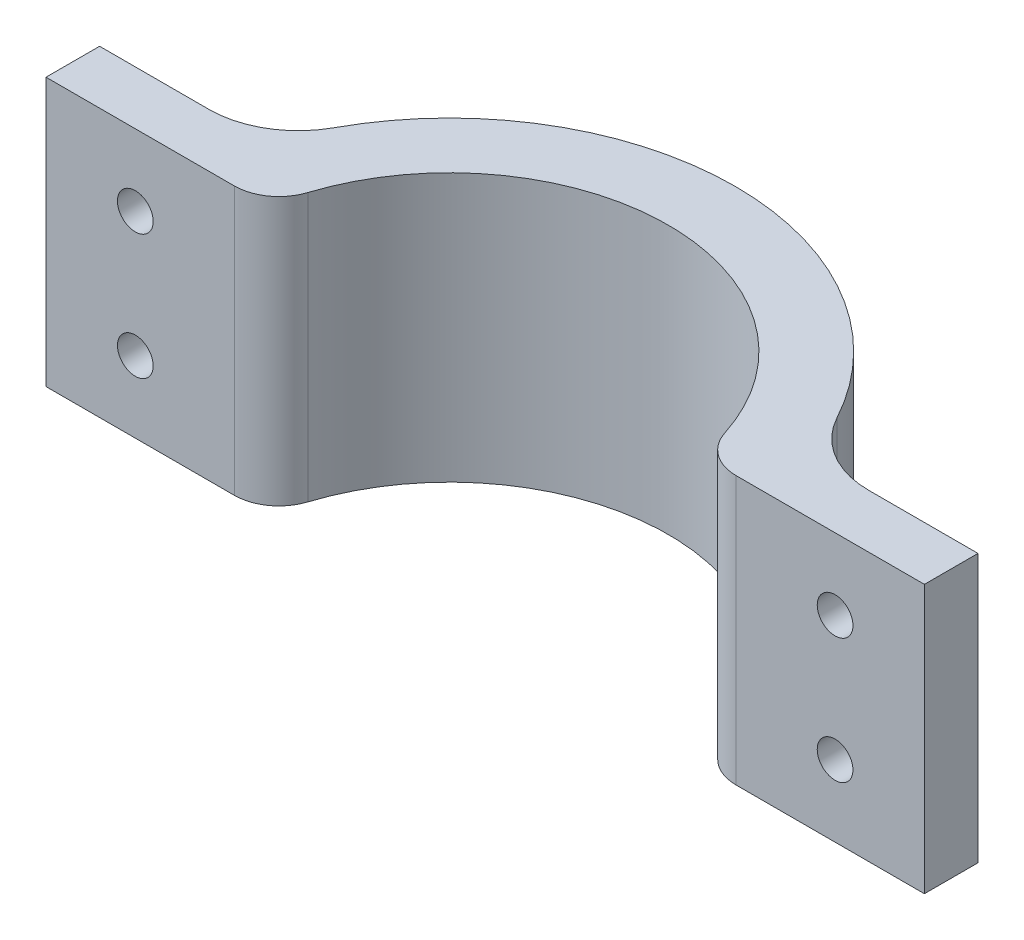
ISO-10303-21;
HEADER;
FILE_DESCRIPTION(('STEP AP214'),'2;1');
FILE_NAME('part.step','',(''),(''),'','','');
FILE_SCHEMA(('AUTOMOTIVE_DESIGN { 1 0 10303 214 1 1 1 1 }'));
ENDSEC;
DATA;
#1=APPLICATION_CONTEXT('core data for automotive mechanical design processes');
#2=APPLICATION_PROTOCOL_DEFINITION('international standard','automotive_design',2000,#1);
#3=PRODUCT_CONTEXT('',#1,'mechanical');
#4=PRODUCT('Part','Part','',(#3));
#5=PRODUCT_RELATED_PRODUCT_CATEGORY('part','',(#4));
#6=PRODUCT_DEFINITION_FORMATION('','',#4);
#7=PRODUCT_DEFINITION_CONTEXT('part definition',#1,'design');
#8=PRODUCT_DEFINITION('design','',#6,#7);
#9=PRODUCT_DEFINITION_SHAPE('','',#8);
#10=(LENGTH_UNIT() NAMED_UNIT(*) SI_UNIT(.MILLI.,.METRE.));
#11=(NAMED_UNIT(*) PLANE_ANGLE_UNIT() SI_UNIT($,.RADIAN.));
#12=(NAMED_UNIT(*) SI_UNIT($,.STERADIAN.) SOLID_ANGLE_UNIT());
#13=UNCERTAINTY_MEASURE_WITH_UNIT(LENGTH_MEASURE(1.E-05),#10,'distance_accuracy_value','');
#14=(GEOMETRIC_REPRESENTATION_CONTEXT(3) GLOBAL_UNCERTAINTY_ASSIGNED_CONTEXT((#13)) GLOBAL_UNIT_ASSIGNED_CONTEXT((#10,
#11,#12)) REPRESENTATION_CONTEXT('',''));
#15=CARTESIAN_POINT('',(0.,0.,0.));
#16=DIRECTION('',(0.,0.,1.));
#17=DIRECTION('',(1.,0.,0.));
#18=AXIS2_PLACEMENT_3D('',#15,#16,#17);
#19=CARTESIAN_POINT('',(0.,30.,0.));
#20=DIRECTION('',(0.,-1.,0.));
#21=DIRECTION('',(0.,0.,-1.));
#22=AXIS2_PLACEMENT_3D('',#19,#20,#21);
#23=CYLINDRICAL_SURFACE('',#22,24.5);
#24=CARTESIAN_POINT('',(0.,30.,0.));
#25=DIRECTION('',(0.,1.,0.));
#26=DIRECTION('',(0.,0.,1.));
#27=AXIS2_PLACEMENT_3D('',#24,#25,#26);
#28=CIRCLE('',#27,24.5);
#29=CARTESIAN_POINT('',(23.3319675459704,30.,-7.47457627118644));
#30=VERTEX_POINT('',#29);
#31=CARTESIAN_POINT('',(-23.3319675459704,30.,-7.47457627118644));
#32=VERTEX_POINT('',#31);
#33=EDGE_CURVE('E137',#30,#32,#28,.T.);
#34=ORIENTED_EDGE('',*,*,#33,.T.);
#35=DIRECTION('',(0.,-1.,0.));
#36=VECTOR('',#35,1.);
#37=CARTESIAN_POINT('',(-23.3319675459704,30.,-7.47457627118644));
#38=LINE('',#37,#36);
#39=CARTESIAN_POINT('',(-23.3319675459704,0.,-7.47457627118644));
#40=VERTEX_POINT('',#39);
#41=EDGE_CURVE('E212',#32,#40,#38,.T.);
#42=ORIENTED_EDGE('',*,*,#41,.T.);
#43=CARTESIAN_POINT('',(0.,0.,0.));
#44=DIRECTION('',(0.,1.,0.));
#45=DIRECTION('',(0.,0.,1.));
#46=AXIS2_PLACEMENT_3D('',#43,#44,#45);
#47=CIRCLE('',#46,24.5);
#48=CARTESIAN_POINT('',(23.3319675459704,0.,-7.47457627118644));
#49=VERTEX_POINT('',#48);
#50=EDGE_CURVE('E168',#49,#40,#47,.T.);
#51=ORIENTED_EDGE('',*,*,#50,.F.);
#52=DIRECTION('',(0.,-1.,0.));
#53=VECTOR('',#52,1.);
#54=CARTESIAN_POINT('',(23.3319675459704,30.,-7.47457627118644));
#55=LINE('',#54,#53);
#56=EDGE_CURVE('E210',#49,#30,#55,.F.);
#57=ORIENTED_EDGE('',*,*,#56,.T.);
#58=EDGE_LOOP('',(#34,#42,#51,#57));
#59=FACE_BOUND('',#58,.T.);
#60=ADVANCED_FACE('F39',(#59),#23,.F.);
#61=CARTESIAN_POINT('',(0.,30.,-4.));
#62=DIRECTION('',(0.,0.,-1.));
#63=DIRECTION('',(-1.,0.,0.));
#64=AXIS2_PLACEMENT_3D('',#61,#62,#63);
#65=PLANE('',#64);
#66=CARTESIAN_POINT('',(39.1712639305436,8.,-3.99999999999997));
#67=DIRECTION('',(0.,0.,-1.));
#68=DIRECTION('',(-1.,0.,0.));
#69=AXIS2_PLACEMENT_3D('',#66,#67,#68);
#70=CIRCLE('',#69,2.);
#71=CARTESIAN_POINT('',(37.1712639305436,8.,-3.99999999999997));
#72=VERTEX_POINT('',#71);
#73=EDGE_CURVE('E412',#72,#72,#70,.T.);
#74=ORIENTED_EDGE('',*,*,#73,.T.);
#75=EDGE_LOOP('',(#74));
#76=FACE_BOUND('',#75,.T.);
#77=CARTESIAN_POINT('',(39.1712639305436,22.,-3.99999999999997));
#78=DIRECTION('',(0.,0.,-1.));
#79=DIRECTION('',(-1.,0.,0.));
#80=AXIS2_PLACEMENT_3D('',#77,#78,#79);
#81=CIRCLE('',#80,2.);
#82=CARTESIAN_POINT('',(37.1712639305436,22.,-3.99999999999997));
#83=VERTEX_POINT('',#82);
#84=EDGE_CURVE('E171',#83,#83,#81,.T.);
#85=ORIENTED_EDGE('',*,*,#84,.T.);
#86=EDGE_LOOP('',(#85));
#87=FACE_BOUND('',#86,.T.);
#88=DIRECTION('',(1.,0.,0.));
#89=VECTOR('',#88,1.);
#90=CARTESIAN_POINT('',(0.,30.,-4.));
#91=LINE('',#90,#89);
#92=CARTESIAN_POINT('',(28.0935935757603,30.,-4.));
#93=VERTEX_POINT('',#92);
#94=CARTESIAN_POINT('',(49.1712639305436,30.,-3.99999999999999));
#95=VERTEX_POINT('',#94);
#96=EDGE_CURVE('E128',#93,#95,#91,.T.);
#97=ORIENTED_EDGE('',*,*,#96,.F.);
#98=DIRECTION('',(0.,1.,0.));
#99=VECTOR('',#98,1.);
#100=CARTESIAN_POINT('',(28.0935935757603,0.,-4.));
#101=LINE('',#100,#99);
#102=CARTESIAN_POINT('',(28.0935935757603,0.,-4.));
#103=VERTEX_POINT('',#102);
#104=EDGE_CURVE('E11',#93,#103,#101,.F.);
#105=ORIENTED_EDGE('',*,*,#104,.T.);
#106=DIRECTION('',(1.,0.,0.));
#107=VECTOR('',#106,1.);
#108=CARTESIAN_POINT('',(0.,0.,-4.));
#109=LINE('',#108,#107);
#110=CARTESIAN_POINT('',(49.1712639305436,0.,-3.99999999999999));
#111=VERTEX_POINT('',#110);
#112=EDGE_CURVE('E143',#103,#111,#109,.T.);
#113=ORIENTED_EDGE('',*,*,#112,.T.);
#114=DIRECTION('',(0.,-1.,0.));
#115=VECTOR('',#114,1.);
#116=CARTESIAN_POINT('',(49.1712639305436,30.,-3.99999999999999));
#117=LINE('',#116,#115);
#118=EDGE_CURVE('E140',#95,#111,#117,.T.);
#119=ORIENTED_EDGE('',*,*,#118,.F.);
#120=EDGE_LOOP('',(#97,#105,#113,#119));
#121=FACE_BOUND('',#120,.T.);
#122=ADVANCED_FACE('F141',(#76,#87,#121),#65,.F.);
#123=CARTESIAN_POINT('',(49.1712639305436,30.,0.));
#124=DIRECTION('',(-1.,0.,0.));
#125=DIRECTION('',(0.,0.,1.));
#126=AXIS2_PLACEMENT_3D('',#123,#124,#125);
#127=PLANE('',#126);
#128=DIRECTION('',(0.,0.,-1.));
#129=VECTOR('',#128,1.);
#130=CARTESIAN_POINT('',(49.1712639305436,0.,0.));
#131=LINE('',#130,#129);
#132=CARTESIAN_POINT('',(49.1712639305436,0.,-9.99999999999999));
#133=VERTEX_POINT('',#132);
#134=EDGE_CURVE('E173',#111,#133,#131,.T.);
#135=ORIENTED_EDGE('',*,*,#134,.T.);
#136=DIRECTION('',(0.,-1.,0.));
#137=VECTOR('',#136,1.);
#138=CARTESIAN_POINT('',(49.1712639305436,30.,-9.99999999999999));
#139=LINE('',#138,#137);
#140=CARTESIAN_POINT('',(49.1712639305436,30.,-9.99999999999999));
#141=VERTEX_POINT('',#140);
#142=EDGE_CURVE('E148',#141,#133,#139,.T.);
#143=ORIENTED_EDGE('',*,*,#142,.F.);
#144=DIRECTION('',(0.,0.,-1.));
#145=VECTOR('',#144,1.);
#146=CARTESIAN_POINT('',(49.1712639305436,30.,0.));
#147=LINE('',#146,#145);
#148=EDGE_CURVE('E133',#95,#141,#147,.T.);
#149=ORIENTED_EDGE('',*,*,#148,.F.);
#150=ORIENTED_EDGE('',*,*,#118,.T.);
#151=EDGE_LOOP('',(#135,#143,#149,#150));
#152=FACE_BOUND('',#151,.T.);
#153=ADVANCED_FACE('F150',(#152),#127,.F.);
#154=CARTESIAN_POINT('',(0.,30.,-10.));
#155=DIRECTION('',(0.,0.,-1.));
#156=DIRECTION('',(-1.,0.,0.));
#157=AXIS2_PLACEMENT_3D('',#154,#155,#156);
#158=PLANE('',#157);
#159=CARTESIAN_POINT('',(39.1712639305436,8.,-9.99999999999999));
#160=DIRECTION('',(0.,0.,-1.));
#161=DIRECTION('',(-1.,0.,0.));
#162=AXIS2_PLACEMENT_3D('',#159,#160,#161);
#163=CIRCLE('',#162,2.);
#164=CARTESIAN_POINT('',(37.1712639305436,8.,-9.99999999999999));
#165=VERTEX_POINT('',#164);
#166=EDGE_CURVE('E415',#165,#165,#163,.T.);
#167=ORIENTED_EDGE('',*,*,#166,.F.);
#168=EDGE_LOOP('',(#167));
#169=FACE_BOUND('',#168,.T.);
#170=CARTESIAN_POINT('',(39.1712639305436,22.,-9.99999999999999));
#171=DIRECTION('',(0.,0.,-1.));
#172=DIRECTION('',(-1.,0.,0.));
#173=AXIS2_PLACEMENT_3D('',#170,#171,#172);
#174=CIRCLE('',#173,2.);
#175=CARTESIAN_POINT('',(37.1712639305436,22.,-9.99999999999999));
#176=VERTEX_POINT('',#175);
#177=EDGE_CURVE('E418',#176,#176,#174,.T.);
#178=ORIENTED_EDGE('',*,*,#177,.F.);
#179=EDGE_LOOP('',(#178));
#180=FACE_BOUND('',#179,.T.);
#181=DIRECTION('',(1.,0.,0.));
#182=VECTOR('',#181,1.);
#183=CARTESIAN_POINT('',(0.,0.,-10.));
#184=LINE('',#183,#182);
#185=CARTESIAN_POINT('',(36.9323706252388,0.,-9.99999999999999));
#186=VERTEX_POINT('',#185);
#187=EDGE_CURVE('E175',#186,#133,#184,.T.);
#188=ORIENTED_EDGE('',*,*,#187,.F.);
#189=DIRECTION('',(0.,-1.,0.));
#190=VECTOR('',#189,1.);
#191=CARTESIAN_POINT('',(36.9323706252388,30.,-9.99999999999999));
#192=LINE('',#191,#190);
#193=CARTESIAN_POINT('',(36.9323706252388,30.,-9.99999999999999));
#194=VERTEX_POINT('',#193);
#195=EDGE_CURVE('E197',#186,#194,#192,.F.);
#196=ORIENTED_EDGE('',*,*,#195,.T.);
#197=DIRECTION('',(1.,0.,0.));
#198=VECTOR('',#197,1.);
#199=CARTESIAN_POINT('',(0.,30.,-10.));
#200=LINE('',#199,#198);
#201=EDGE_CURVE('E152',#194,#141,#200,.T.);
#202=ORIENTED_EDGE('',*,*,#201,.T.);
#203=ORIENTED_EDGE('',*,*,#142,.T.);
#204=EDGE_LOOP('',(#188,#196,#202,#203));
#205=FACE_BOUND('',#204,.T.);
#206=ADVANCED_FACE('F257',(#169,#180,#205),#158,.T.);
#207=CARTESIAN_POINT('',(0.,30.,0.));
#208=DIRECTION('',(0.,-1.,0.));
#209=DIRECTION('',(0.,0.,-1.));
#210=AXIS2_PLACEMENT_3D('',#207,#208,#209);
#211=CYLINDRICAL_SURFACE('',#210,32.);
#212=CARTESIAN_POINT('',(0.,30.,0.));
#213=DIRECTION('',(0.,1.,0.));
#214=DIRECTION('',(0.,0.,1.));
#215=AXIS2_PLACEMENT_3D('',#212,#213,#214);
#216=CIRCLE('',#215,32.);
#217=CARTESIAN_POINT('',(28.138949047801,30.,-15.2380952380952));
#218=VERTEX_POINT('',#217);
#219=CARTESIAN_POINT('',(-28.138949047801,30.,-15.2380952380952));
#220=VERTEX_POINT('',#219);
#221=EDGE_CURVE('E154',#218,#220,#216,.T.);
#222=ORIENTED_EDGE('',*,*,#221,.F.);
#223=DIRECTION('',(0.,-1.,0.));
#224=VECTOR('',#223,1.);
#225=CARTESIAN_POINT('',(28.138949047801,30.,-15.2380952380952));
#226=LINE('',#225,#224);
#227=CARTESIAN_POINT('',(28.138949047801,0.,-15.2380952380952));
#228=VERTEX_POINT('',#227);
#229=EDGE_CURVE('E194',#218,#228,#226,.T.);
#230=ORIENTED_EDGE('',*,*,#229,.T.);
#231=CARTESIAN_POINT('',(0.,0.,0.));
#232=DIRECTION('',(0.,1.,0.));
#233=DIRECTION('',(0.,0.,1.));
#234=AXIS2_PLACEMENT_3D('',#231,#232,#233);
#235=CIRCLE('',#234,32.);
#236=CARTESIAN_POINT('',(-28.138949047801,0.,-15.2380952380952));
#237=VERTEX_POINT('',#236);
#238=EDGE_CURVE('E177',#228,#237,#235,.T.);
#239=ORIENTED_EDGE('',*,*,#238,.T.);
#240=DIRECTION('',(0.,-1.,0.));
#241=VECTOR('',#240,1.);
#242=CARTESIAN_POINT('',(-28.138949047801,30.,-15.2380952380952));
#243=LINE('',#242,#241);
#244=EDGE_CURVE('E147',#237,#220,#243,.F.);
#245=ORIENTED_EDGE('',*,*,#244,.T.);
#246=EDGE_LOOP('',(#222,#230,#239,#245));
#247=FACE_BOUND('',#246,.T.);
#248=ADVANCED_FACE('F249',(#247),#211,.T.);
#249=CARTESIAN_POINT('',(0.,30.,-10.));
#250=DIRECTION('',(0.,0.,1.));
#251=DIRECTION('',(1.,0.,0.));
#252=AXIS2_PLACEMENT_3D('',#249,#250,#251);
#253=PLANE('',#252);
#254=CARTESIAN_POINT('',(-39.1712639305436,22.,-10.));
#255=DIRECTION('',(0.,0.,-1.));
#256=DIRECTION('',(1.,0.,0.));
#257=AXIS2_PLACEMENT_3D('',#254,#255,#256);
#258=CIRCLE('',#257,2.);
#259=CARTESIAN_POINT('',(-37.1712639305436,22.,-10.));
#260=VERTEX_POINT('',#259);
#261=EDGE_CURVE('E429',#260,#260,#258,.T.);
#262=ORIENTED_EDGE('',*,*,#261,.F.);
#263=EDGE_LOOP('',(#262));
#264=FACE_BOUND('',#263,.T.);
#265=CARTESIAN_POINT('',(-39.1712639305436,8.,-10.));
#266=DIRECTION('',(0.,0.,-1.));
#267=DIRECTION('',(1.,0.,0.));
#268=AXIS2_PLACEMENT_3D('',#265,#266,#267);
#269=CIRCLE('',#268,2.);
#270=CARTESIAN_POINT('',(-37.1712639305436,8.,-10.));
#271=VERTEX_POINT('',#270);
#272=EDGE_CURVE('E421',#271,#271,#269,.T.);
#273=ORIENTED_EDGE('',*,*,#272,.F.);
#274=EDGE_LOOP('',(#273));
#275=FACE_BOUND('',#274,.T.);
#276=DIRECTION('',(-1.,0.,0.));
#277=VECTOR('',#276,1.);
#278=CARTESIAN_POINT('',(0.,30.,-10.));
#279=LINE('',#278,#277);
#280=CARTESIAN_POINT('',(-36.9323706252388,30.,-9.99999999999999));
#281=VERTEX_POINT('',#280);
#282=CARTESIAN_POINT('',(-49.1712639305436,30.,-9.99999999999999));
#283=VERTEX_POINT('',#282);
#284=EDGE_CURVE('E160',#281,#283,#279,.T.);
#285=ORIENTED_EDGE('',*,*,#284,.F.);
#286=DIRECTION('',(0.,1.,0.));
#287=VECTOR('',#286,1.);
#288=CARTESIAN_POINT('',(-36.9323706252388,0.,-9.99999999999999));
#289=LINE('',#288,#287);
#290=CARTESIAN_POINT('',(-36.9323706252388,0.,-9.99999999999999));
#291=VERTEX_POINT('',#290);
#292=EDGE_CURVE('E199',#281,#291,#289,.F.);
#293=ORIENTED_EDGE('',*,*,#292,.T.);
#294=DIRECTION('',(-1.,0.,0.));
#295=VECTOR('',#294,1.);
#296=CARTESIAN_POINT('',(0.,0.,-10.));
#297=LINE('',#296,#295);
#298=CARTESIAN_POINT('',(-49.1712639305436,0.,-9.99999999999999));
#299=VERTEX_POINT('',#298);
#300=EDGE_CURVE('E180',#291,#299,#297,.T.);
#301=ORIENTED_EDGE('',*,*,#300,.T.);
#302=DIRECTION('',(0.,-1.,0.));
#303=VECTOR('',#302,1.);
#304=CARTESIAN_POINT('',(-49.1712639305436,30.,-9.99999999999999));
#305=LINE('',#304,#303);
#306=EDGE_CURVE('E189',#283,#299,#305,.T.);
#307=ORIENTED_EDGE('',*,*,#306,.F.);
#308=EDGE_LOOP('',(#285,#293,#301,#307));
#309=FACE_BOUND('',#308,.T.);
#310=ADVANCED_FACE('F241',(#264,#275,#309),#253,.F.);
#311=CARTESIAN_POINT('',(-49.1712639305436,30.,0.));
#312=DIRECTION('',(-1.,0.,0.));
#313=DIRECTION('',(0.,0.,1.));
#314=AXIS2_PLACEMENT_3D('',#311,#312,#313);
#315=PLANE('',#314);
#316=DIRECTION('',(0.,0.,-1.));
#317=VECTOR('',#316,1.);
#318=CARTESIAN_POINT('',(-49.1712639305436,0.,0.));
#319=LINE('',#318,#317);
#320=CARTESIAN_POINT('',(-49.1712639305436,0.,-3.99999999999999));
#321=VERTEX_POINT('',#320);
#322=EDGE_CURVE('E182',#321,#299,#319,.T.);
#323=ORIENTED_EDGE('',*,*,#322,.F.);
#324=DIRECTION('',(0.,-1.,0.));
#325=VECTOR('',#324,1.);
#326=CARTESIAN_POINT('',(-49.1712639305436,30.,-3.99999999999999));
#327=LINE('',#326,#325);
#328=CARTESIAN_POINT('',(-49.1712639305436,30.,-3.99999999999999));
#329=VERTEX_POINT('',#328);
#330=EDGE_CURVE('E167',#329,#321,#327,.T.);
#331=ORIENTED_EDGE('',*,*,#330,.F.);
#332=DIRECTION('',(0.,0.,-1.));
#333=VECTOR('',#332,1.);
#334=CARTESIAN_POINT('',(-49.1712639305436,30.,0.));
#335=LINE('',#334,#333);
#336=EDGE_CURVE('E162',#329,#283,#335,.T.);
#337=ORIENTED_EDGE('',*,*,#336,.T.);
#338=ORIENTED_EDGE('',*,*,#306,.T.);
#339=EDGE_LOOP('',(#323,#331,#337,#338));
#340=FACE_BOUND('',#339,.T.);
#341=ADVANCED_FACE('F235',(#340),#315,.T.);
#342=CARTESIAN_POINT('',(0.,30.,-4.));
#343=DIRECTION('',(0.,0.,1.));
#344=DIRECTION('',(1.,0.,0.));
#345=AXIS2_PLACEMENT_3D('',#342,#343,#344);
#346=PLANE('',#345);
#347=CARTESIAN_POINT('',(-39.1712639305436,22.,-3.99999999999999));
#348=DIRECTION('',(0.,0.,-1.));
#349=DIRECTION('',(1.,0.,0.));
#350=AXIS2_PLACEMENT_3D('',#347,#348,#349);
#351=CIRCLE('',#350,2.);
#352=CARTESIAN_POINT('',(-37.1712639305436,22.,-3.99999999999999));
#353=VERTEX_POINT('',#352);
#354=EDGE_CURVE('E426',#353,#353,#351,.T.);
#355=ORIENTED_EDGE('',*,*,#354,.T.);
#356=EDGE_LOOP('',(#355));
#357=FACE_BOUND('',#356,.T.);
#358=CARTESIAN_POINT('',(-39.1712639305436,8.,-3.99999999999999));
#359=DIRECTION('',(0.,0.,-1.));
#360=DIRECTION('',(1.,0.,0.));
#361=AXIS2_PLACEMENT_3D('',#358,#359,#360);
#362=CIRCLE('',#361,2.);
#363=CARTESIAN_POINT('',(-37.1712639305436,8.,-3.99999999999999));
#364=VERTEX_POINT('',#363);
#365=EDGE_CURVE('E416',#364,#364,#362,.T.);
#366=ORIENTED_EDGE('',*,*,#365,.T.);
#367=EDGE_LOOP('',(#366));
#368=FACE_BOUND('',#367,.T.);
#369=DIRECTION('',(-1.,0.,0.));
#370=VECTOR('',#369,1.);
#371=CARTESIAN_POINT('',(0.,0.,-4.));
#372=LINE('',#371,#370);
#373=CARTESIAN_POINT('',(-28.0935935757603,0.,-4.));
#374=VERTEX_POINT('',#373);
#375=EDGE_CURVE('E185',#374,#321,#372,.T.);
#376=ORIENTED_EDGE('',*,*,#375,.F.);
#377=DIRECTION('',(0.,-1.,0.));
#378=VECTOR('',#377,1.);
#379=CARTESIAN_POINT('',(-28.0935935757603,30.,-4.));
#380=LINE('',#379,#378);
#381=CARTESIAN_POINT('',(-28.0935935757603,30.,-4.));
#382=VERTEX_POINT('',#381);
#383=EDGE_CURVE('E62',#374,#382,#380,.F.);
#384=ORIENTED_EDGE('',*,*,#383,.T.);
#385=DIRECTION('',(-1.,0.,0.));
#386=VECTOR('',#385,1.);
#387=CARTESIAN_POINT('',(0.,30.,-4.));
#388=LINE('',#387,#386);
#389=EDGE_CURVE('E165',#382,#329,#388,.T.);
#390=ORIENTED_EDGE('',*,*,#389,.T.);
#391=ORIENTED_EDGE('',*,*,#330,.T.);
#392=EDGE_LOOP('',(#376,#384,#390,#391));
#393=FACE_BOUND('',#392,.T.);
#394=ADVANCED_FACE('F231',(#357,#368,#393),#346,.T.);
#395=CARTESIAN_POINT('',(0.,30.,0.));
#396=DIRECTION('',(0.,1.,0.));
#397=DIRECTION('',(0.,0.,1.));
#398=AXIS2_PLACEMENT_3D('',#395,#396,#397);
#399=PLANE('',#398);
#400=ORIENTED_EDGE('',*,*,#389,.F.);
#401=CARTESIAN_POINT('',(-28.0935935757603,30.,-9.));
#402=DIRECTION('',(0.,1.,0.));
#403=DIRECTION('',(0.,0.,1.));
#404=AXIS2_PLACEMENT_3D('',#401,#402,#403);
#405=CIRCLE('',#404,5.);
#406=EDGE_CURVE('E47',#382,#32,#405,.T.);
#407=ORIENTED_EDGE('',*,*,#406,.T.);
#408=ORIENTED_EDGE('',*,*,#33,.F.);
#409=CARTESIAN_POINT('',(28.0935935757603,30.,-9.));
#410=DIRECTION('',(0.,1.,0.));
#411=DIRECTION('',(0.,0.,1.));
#412=AXIS2_PLACEMENT_3D('',#409,#410,#411);
#413=CIRCLE('',#412,5.);
#414=EDGE_CURVE('E54',#30,#93,#413,.T.);
#415=ORIENTED_EDGE('',*,*,#414,.T.);
#416=ORIENTED_EDGE('',*,*,#96,.T.);
#417=ORIENTED_EDGE('',*,*,#148,.T.);
#418=ORIENTED_EDGE('',*,*,#201,.F.);
#419=CARTESIAN_POINT('',(36.9323706252388,30.,-20.));
#420=DIRECTION('',(0.,1.,0.));
#421=DIRECTION('',(0.,0.,1.));
#422=AXIS2_PLACEMENT_3D('',#419,#420,#421);
#423=CIRCLE('',#422,10.);
#424=EDGE_CURVE('E204',#194,#218,#423,.F.);
#425=ORIENTED_EDGE('',*,*,#424,.T.);
#426=ORIENTED_EDGE('',*,*,#221,.T.);
#427=CARTESIAN_POINT('',(-36.9323706252388,30.,-20.));
#428=DIRECTION('',(0.,1.,0.));
#429=DIRECTION('',(0.,0.,1.));
#430=AXIS2_PLACEMENT_3D('',#427,#428,#429);
#431=CIRCLE('',#430,10.);
#432=EDGE_CURVE('E208',#220,#281,#431,.F.);
#433=ORIENTED_EDGE('',*,*,#432,.T.);
#434=ORIENTED_EDGE('',*,*,#284,.T.);
#435=ORIENTED_EDGE('',*,*,#336,.F.);
#436=EDGE_LOOP('',(#400,#407,#408,#415,#416,#417,#418,#425,#426,#433,#434,#435));
#437=FACE_BOUND('',#436,.T.);
#438=ADVANCED_FACE('F130',(#437),#399,.T.);
#439=CARTESIAN_POINT('',(0.,0.,0.));
#440=DIRECTION('',(0.,1.,0.));
#441=DIRECTION('',(0.,0.,1.));
#442=AXIS2_PLACEMENT_3D('',#439,#440,#441);
#443=PLANE('',#442);
#444=ORIENTED_EDGE('',*,*,#50,.T.);
#445=CARTESIAN_POINT('',(-28.0935935757603,0.,-9.));
#446=DIRECTION('',(0.,1.,0.));
#447=DIRECTION('',(0.,0.,1.));
#448=AXIS2_PLACEMENT_3D('',#445,#446,#447);
#449=CIRCLE('',#448,5.);
#450=EDGE_CURVE('E217',#40,#374,#449,.F.);
#451=ORIENTED_EDGE('',*,*,#450,.T.);
#452=ORIENTED_EDGE('',*,*,#375,.T.);
#453=ORIENTED_EDGE('',*,*,#322,.T.);
#454=ORIENTED_EDGE('',*,*,#300,.F.);
#455=CARTESIAN_POINT('',(-36.9323706252388,0.,-20.));
#456=DIRECTION('',(0.,1.,0.));
#457=DIRECTION('',(0.,0.,1.));
#458=AXIS2_PLACEMENT_3D('',#455,#456,#457);
#459=CIRCLE('',#458,10.);
#460=EDGE_CURVE('E206',#291,#237,#459,.T.);
#461=ORIENTED_EDGE('',*,*,#460,.T.);
#462=ORIENTED_EDGE('',*,*,#238,.F.);
#463=CARTESIAN_POINT('',(36.9323706252388,0.,-20.));
#464=DIRECTION('',(0.,1.,0.));
#465=DIRECTION('',(0.,0.,1.));
#466=AXIS2_PLACEMENT_3D('',#463,#464,#465);
#467=CIRCLE('',#466,10.);
#468=EDGE_CURVE('E202',#228,#186,#467,.T.);
#469=ORIENTED_EDGE('',*,*,#468,.T.);
#470=ORIENTED_EDGE('',*,*,#187,.T.);
#471=ORIENTED_EDGE('',*,*,#134,.F.);
#472=ORIENTED_EDGE('',*,*,#112,.F.);
#473=CARTESIAN_POINT('',(28.0935935757603,0.,-9.));
#474=DIRECTION('',(0.,1.,0.));
#475=DIRECTION('',(0.,0.,1.));
#476=AXIS2_PLACEMENT_3D('',#473,#474,#475);
#477=CIRCLE('',#476,5.);
#478=EDGE_CURVE('E215',#103,#49,#477,.F.);
#479=ORIENTED_EDGE('',*,*,#478,.T.);
#480=EDGE_LOOP('',(#444,#451,#452,#453,#454,#461,#462,#469,#470,#471,#472,#479));
#481=FACE_BOUND('',#480,.T.);
#482=ADVANCED_FACE('F230',(#481),#443,.F.);
#483=CARTESIAN_POINT('',(-39.1712639305436,8.,-3.99999999999999));
#484=DIRECTION('',(0.,0.,-1.));
#485=DIRECTION('',(-1.,0.,0.));
#486=AXIS2_PLACEMENT_3D('',#483,#484,#485);
#487=CYLINDRICAL_SURFACE('',#486,2.);
#488=ORIENTED_EDGE('',*,*,#365,.F.);
#489=EDGE_LOOP('',(#488));
#490=FACE_BOUND('',#489,.T.);
#491=ORIENTED_EDGE('',*,*,#272,.T.);
#492=EDGE_LOOP('',(#491));
#493=FACE_BOUND('',#492,.T.);
#494=ADVANCED_FACE('F298',(#490,#493),#487,.F.);
#495=CARTESIAN_POINT('',(-39.1712639305436,22.,-3.99999999999999));
#496=DIRECTION('',(0.,0.,-1.));
#497=DIRECTION('',(-1.,0.,0.));
#498=AXIS2_PLACEMENT_3D('',#495,#496,#497);
#499=CYLINDRICAL_SURFACE('',#498,2.);
#500=ORIENTED_EDGE('',*,*,#354,.F.);
#501=EDGE_LOOP('',(#500));
#502=FACE_BOUND('',#501,.T.);
#503=ORIENTED_EDGE('',*,*,#261,.T.);
#504=EDGE_LOOP('',(#503));
#505=FACE_BOUND('',#504,.T.);
#506=ADVANCED_FACE('F372',(#502,#505),#499,.F.);
#507=CARTESIAN_POINT('',(39.1712639305436,22.,-3.99999999999997));
#508=DIRECTION('',(0.,0.,-1.));
#509=DIRECTION('',(-1.,0.,0.));
#510=AXIS2_PLACEMENT_3D('',#507,#508,#509);
#511=CYLINDRICAL_SURFACE('',#510,2.);
#512=ORIENTED_EDGE('',*,*,#84,.F.);
#513=EDGE_LOOP('',(#512));
#514=FACE_BOUND('',#513,.T.);
#515=ORIENTED_EDGE('',*,*,#177,.T.);
#516=EDGE_LOOP('',(#515));
#517=FACE_BOUND('',#516,.T.);
#518=ADVANCED_FACE('F382',(#514,#517),#511,.F.);
#519=CARTESIAN_POINT('',(39.1712639305436,8.,-3.99999999999997));
#520=DIRECTION('',(0.,0.,-1.));
#521=DIRECTION('',(-1.,0.,0.));
#522=AXIS2_PLACEMENT_3D('',#519,#520,#521);
#523=CYLINDRICAL_SURFACE('',#522,2.);
#524=ORIENTED_EDGE('',*,*,#73,.F.);
#525=EDGE_LOOP('',(#524));
#526=FACE_BOUND('',#525,.T.);
#527=ORIENTED_EDGE('',*,*,#166,.T.);
#528=EDGE_LOOP('',(#527));
#529=FACE_BOUND('',#528,.T.);
#530=ADVANCED_FACE('F274',(#526,#529),#523,.F.);
#531=CARTESIAN_POINT('',(36.9323706252388,30.,-20.));
#532=DIRECTION('',(0.,-1.,0.));
#533=DIRECTION('',(0.,0.,-1.));
#534=AXIS2_PLACEMENT_3D('',#531,#532,#533);
#535=CYLINDRICAL_SURFACE('',#534,10.);
#536=ORIENTED_EDGE('',*,*,#424,.F.);
#537=ORIENTED_EDGE('',*,*,#195,.F.);
#538=ORIENTED_EDGE('',*,*,#468,.F.);
#539=ORIENTED_EDGE('',*,*,#229,.F.);
#540=EDGE_LOOP('',(#536,#537,#538,#539));
#541=FACE_BOUND('',#540,.T.);
#542=ADVANCED_FACE('F254',(#541),#535,.F.);
#543=CARTESIAN_POINT('',(-36.9323706252388,30.,-20.));
#544=DIRECTION('',(0.,-1.,0.));
#545=DIRECTION('',(0.,0.,-1.));
#546=AXIS2_PLACEMENT_3D('',#543,#544,#545);
#547=CYLINDRICAL_SURFACE('',#546,10.);
#548=ORIENTED_EDGE('',*,*,#432,.F.);
#549=ORIENTED_EDGE('',*,*,#244,.F.);
#550=ORIENTED_EDGE('',*,*,#460,.F.);
#551=ORIENTED_EDGE('',*,*,#292,.F.);
#552=EDGE_LOOP('',(#548,#549,#550,#551));
#553=FACE_BOUND('',#552,.T.);
#554=ADVANCED_FACE('F245',(#553),#547,.F.);
#555=CARTESIAN_POINT('',(-28.0935935757603,30.,-9.));
#556=DIRECTION('',(0.,-1.,0.));
#557=DIRECTION('',(0.,0.,-1.));
#558=AXIS2_PLACEMENT_3D('',#555,#556,#557);
#559=CYLINDRICAL_SURFACE('',#558,5.);
#560=ORIENTED_EDGE('',*,*,#406,.F.);
#561=ORIENTED_EDGE('',*,*,#383,.F.);
#562=ORIENTED_EDGE('',*,*,#450,.F.);
#563=ORIENTED_EDGE('',*,*,#41,.F.);
#564=EDGE_LOOP('',(#560,#561,#562,#563));
#565=FACE_BOUND('',#564,.T.);
#566=ADVANCED_FACE('F228',(#565),#559,.T.);
#567=CARTESIAN_POINT('',(28.0935935757603,30.,-9.));
#568=DIRECTION('',(0.,-1.,0.));
#569=DIRECTION('',(0.,0.,-1.));
#570=AXIS2_PLACEMENT_3D('',#567,#568,#569);
#571=CYLINDRICAL_SURFACE('',#570,5.);
#572=ORIENTED_EDGE('',*,*,#414,.F.);
#573=ORIENTED_EDGE('',*,*,#56,.F.);
#574=ORIENTED_EDGE('',*,*,#478,.F.);
#575=ORIENTED_EDGE('',*,*,#104,.F.);
#576=EDGE_LOOP('',(#572,#573,#574,#575));
#577=FACE_BOUND('',#576,.T.);
#578=ADVANCED_FACE('F41',(#577),#571,.T.);
#579=CLOSED_SHELL('',(#60,#122,#153,#206,#248,#310,#341,#394,#438,#482,#494,#506,#518,#530,#542,
#554,#566,#578));
#580=MANIFOLD_SOLID_BREP('B2',#579);
#581=ADVANCED_BREP_SHAPE_REPRESENTATION('',(#18,#580),#14);
#582=SHAPE_DEFINITION_REPRESENTATION(#9,#581);
ENDSEC;
END-ISO-10303-21;
